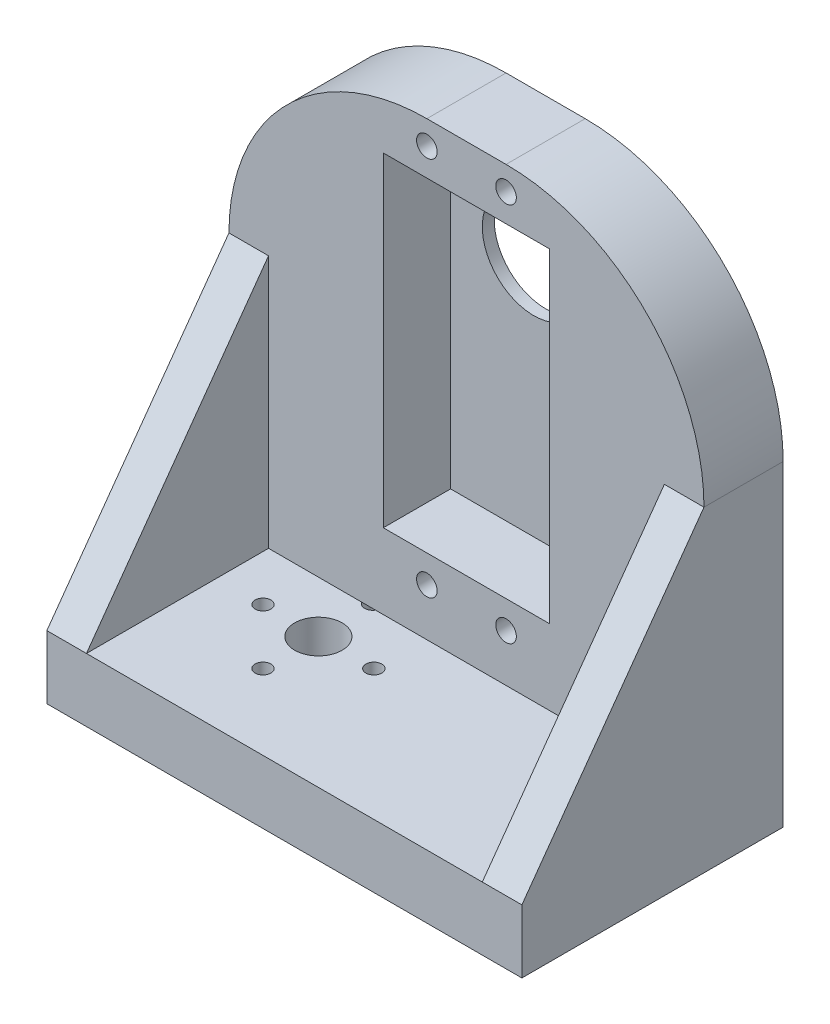
ISO-10303-21;
HEADER;
FILE_DESCRIPTION(('STEP AP214'),'2;1');
FILE_NAME('part.step','',(''),(''),'','','');
FILE_SCHEMA(('AUTOMOTIVE_DESIGN { 1 0 10303 214 1 1 1 1 }'));
ENDSEC;
DATA;
#1=APPLICATION_CONTEXT('core data for automotive mechanical design processes');
#2=APPLICATION_PROTOCOL_DEFINITION('international standard','automotive_design',2000,#1);
#3=PRODUCT_CONTEXT('',#1,'mechanical');
#4=PRODUCT('Part','Part','',(#3));
#5=PRODUCT_RELATED_PRODUCT_CATEGORY('part','',(#4));
#6=PRODUCT_DEFINITION_FORMATION('','',#4);
#7=PRODUCT_DEFINITION_CONTEXT('part definition',#1,'design');
#8=PRODUCT_DEFINITION('design','',#6,#7);
#9=PRODUCT_DEFINITION_SHAPE('','',#8);
#10=(LENGTH_UNIT() NAMED_UNIT(*) SI_UNIT(.MILLI.,.METRE.));
#11=(NAMED_UNIT(*) PLANE_ANGLE_UNIT() SI_UNIT($,.RADIAN.));
#12=(NAMED_UNIT(*) SI_UNIT($,.STERADIAN.) SOLID_ANGLE_UNIT());
#13=UNCERTAINTY_MEASURE_WITH_UNIT(LENGTH_MEASURE(1.E-05),#10,'distance_accuracy_value','');
#14=(GEOMETRIC_REPRESENTATION_CONTEXT(3) GLOBAL_UNCERTAINTY_ASSIGNED_CONTEXT((#13)) GLOBAL_UNIT_ASSIGNED_CONTEXT((#10,
#11,#12)) REPRESENTATION_CONTEXT('',''));
#15=CARTESIAN_POINT('',(0.,0.,0.));
#16=DIRECTION('',(0.,0.,1.));
#17=DIRECTION('',(1.,0.,0.));
#18=AXIS2_PLACEMENT_3D('',#15,#16,#17);
#19=CARTESIAN_POINT('',(-12.2,65.,0.));
#20=DIRECTION('',(0.,-1.,0.));
#21=DIRECTION('',(0.,0.,-1.));
#22=AXIS2_PLACEMENT_3D('',#19,#20,#21);
#23=CYLINDRICAL_SURFACE('',#22,3.);
#24=CARTESIAN_POINT('',(-12.2,8.,0.));
#25=DIRECTION('',(0.,-1.,0.));
#26=DIRECTION('',(0.,0.,-1.));
#27=AXIS2_PLACEMENT_3D('',#24,#25,#26);
#28=CIRCLE('',#27,3.);
#29=CARTESIAN_POINT('',(-12.2,8.,-3.));
#30=VERTEX_POINT('',#29);
#31=EDGE_CURVE('E243',#30,#30,#28,.T.);
#32=ORIENTED_EDGE('',*,*,#31,.F.);
#33=EDGE_LOOP('',(#32));
#34=FACE_BOUND('',#33,.T.);
#35=CARTESIAN_POINT('',(-12.2,2.3,0.));
#36=DIRECTION('',(0.,-1.,0.));
#37=DIRECTION('',(0.,0.,-1.));
#38=AXIS2_PLACEMENT_3D('',#35,#36,#37);
#39=CIRCLE('',#38,3.);
#40=CARTESIAN_POINT('',(-12.2,2.3,-3.));
#41=VERTEX_POINT('',#40);
#42=EDGE_CURVE('E265',#41,#41,#39,.F.);
#43=ORIENTED_EDGE('',*,*,#42,.F.);
#44=EDGE_LOOP('',(#43));
#45=FACE_BOUND('',#44,.T.);
#46=ADVANCED_FACE('F38',(#34,#45),#23,.F.);
#47=CARTESIAN_POINT('',(-19.2,65.,0.));
#48=DIRECTION('',(0.,-1.,0.));
#49=DIRECTION('',(0.,0.,-1.));
#50=AXIS2_PLACEMENT_3D('',#47,#48,#49);
#51=CYLINDRICAL_SURFACE('',#50,1.);
#52=CARTESIAN_POINT('',(-19.2,8.,0.));
#53=DIRECTION('',(0.,-1.,0.));
#54=DIRECTION('',(0.,0.,-1.));
#55=AXIS2_PLACEMENT_3D('',#52,#53,#54);
#56=CIRCLE('',#55,1.);
#57=CARTESIAN_POINT('',(-19.2,8.,-1.));
#58=VERTEX_POINT('',#57);
#59=EDGE_CURVE('E468',#58,#58,#56,.T.);
#60=ORIENTED_EDGE('',*,*,#59,.F.);
#61=EDGE_LOOP('',(#60));
#62=FACE_BOUND('',#61,.T.);
#63=CARTESIAN_POINT('',(-19.2,2.3,0.));
#64=DIRECTION('',(0.,-1.,0.));
#65=DIRECTION('',(0.,0.,-1.));
#66=AXIS2_PLACEMENT_3D('',#63,#64,#65);
#67=CIRCLE('',#66,1.);
#68=CARTESIAN_POINT('',(-19.2,2.3,-1.));
#69=VERTEX_POINT('',#68);
#70=EDGE_CURVE('E270',#69,#69,#67,.F.);
#71=ORIENTED_EDGE('',*,*,#70,.F.);
#72=EDGE_LOOP('',(#71));
#73=FACE_BOUND('',#72,.T.);
#74=ADVANCED_FACE('F302',(#62,#73),#51,.F.);
#75=CARTESIAN_POINT('',(-5.2,65.,0.));
#76=DIRECTION('',(0.,-1.,0.));
#77=DIRECTION('',(0.,0.,-1.));
#78=AXIS2_PLACEMENT_3D('',#75,#76,#77);
#79=CYLINDRICAL_SURFACE('',#78,1.);
#80=CARTESIAN_POINT('',(-5.2,8.,0.));
#81=DIRECTION('',(0.,-1.,0.));
#82=DIRECTION('',(0.,0.,-1.));
#83=AXIS2_PLACEMENT_3D('',#80,#81,#82);
#84=CIRCLE('',#83,1.);
#85=CARTESIAN_POINT('',(-5.2,8.,-1.));
#86=VERTEX_POINT('',#85);
#87=EDGE_CURVE('E466',#86,#86,#84,.T.);
#88=ORIENTED_EDGE('',*,*,#87,.F.);
#89=EDGE_LOOP('',(#88));
#90=FACE_BOUND('',#89,.T.);
#91=CARTESIAN_POINT('',(-5.2,2.3,0.));
#92=DIRECTION('',(0.,-1.,0.));
#93=DIRECTION('',(0.,0.,-1.));
#94=AXIS2_PLACEMENT_3D('',#91,#92,#93);
#95=CIRCLE('',#94,1.);
#96=CARTESIAN_POINT('',(-5.2,2.3,-1.));
#97=VERTEX_POINT('',#96);
#98=EDGE_CURVE('E273',#97,#97,#95,.F.);
#99=ORIENTED_EDGE('',*,*,#98,.F.);
#100=EDGE_LOOP('',(#99));
#101=FACE_BOUND('',#100,.T.);
#102=ADVANCED_FACE('F308',(#90,#101),#79,.F.);
#103=CARTESIAN_POINT('',(-12.2,65.,7.));
#104=DIRECTION('',(0.,-1.,0.));
#105=DIRECTION('',(0.,0.,-1.));
#106=AXIS2_PLACEMENT_3D('',#103,#104,#105);
#107=CYLINDRICAL_SURFACE('',#106,1.);
#108=CARTESIAN_POINT('',(-12.2,7.99999999999999,7.));
#109=DIRECTION('',(0.,-1.,0.));
#110=DIRECTION('',(0.,0.,-1.));
#111=AXIS2_PLACEMENT_3D('',#108,#109,#110);
#112=CIRCLE('',#111,1.);
#113=CARTESIAN_POINT('',(-12.2,7.99999999999999,6.));
#114=VERTEX_POINT('',#113);
#115=EDGE_CURVE('E223',#114,#114,#112,.T.);
#116=ORIENTED_EDGE('',*,*,#115,.F.);
#117=EDGE_LOOP('',(#116));
#118=FACE_BOUND('',#117,.T.);
#119=CARTESIAN_POINT('',(-12.2,2.3,7.));
#120=DIRECTION('',(0.,-1.,0.));
#121=DIRECTION('',(0.,0.,-1.));
#122=AXIS2_PLACEMENT_3D('',#119,#120,#121);
#123=CIRCLE('',#122,1.);
#124=CARTESIAN_POINT('',(-12.2,2.3,6.));
#125=VERTEX_POINT('',#124);
#126=EDGE_CURVE('E42',#125,#125,#123,.F.);
#127=ORIENTED_EDGE('',*,*,#126,.F.);
#128=EDGE_LOOP('',(#127));
#129=FACE_BOUND('',#128,.T.);
#130=ADVANCED_FACE('F314',(#118,#129),#107,.F.);
#131=CARTESIAN_POINT('',(30.,8.,-6.49999999999999));
#132=DIRECTION('',(0.,-1.,0.));
#133=DIRECTION('',(0.,0.,-1.));
#134=AXIS2_PLACEMENT_3D('',#131,#132,#133);
#135=PLANE('',#134);
#136=ORIENTED_EDGE('',*,*,#115,.T.);
#137=EDGE_LOOP('',(#136));
#138=FACE_BOUND('',#137,.T.);
#139=ORIENTED_EDGE('',*,*,#87,.T.);
#140=EDGE_LOOP('',(#139));
#141=FACE_BOUND('',#140,.T.);
#142=ORIENTED_EDGE('',*,*,#59,.T.);
#143=EDGE_LOOP('',(#142));
#144=FACE_BOUND('',#143,.T.);
#145=ORIENTED_EDGE('',*,*,#31,.T.);
#146=EDGE_LOOP('',(#145));
#147=FACE_BOUND('',#146,.T.);
#148=DIRECTION('',(-1.,0.,0.));
#149=VECTOR('',#148,1.);
#150=CARTESIAN_POINT('',(30.,8.,-6.49999999999999));
#151=LINE('',#150,#149);
#152=CARTESIAN_POINT('',(25.,8.,-6.49999999999999));
#153=VERTEX_POINT('',#152);
#154=CARTESIAN_POINT('',(-11.4848258860183,8.,-6.49999999999999));
#155=VERTEX_POINT('',#154);
#156=EDGE_CURVE('E152',#153,#155,#151,.T.);
#157=ORIENTED_EDGE('',*,*,#156,.T.);
#158=CARTESIAN_POINT('',(-12.3508512898027,8.,-7.));
#159=DIRECTION('',(0.,-1.,0.));
#160=DIRECTION('',(0.,0.,-1.));
#161=AXIS2_PLACEMENT_3D('',#158,#159,#160);
#162=CIRCLE('',#161,1.);
#163=CARTESIAN_POINT('',(-13.2168766935871,8.,-6.49999999999999));
#164=VERTEX_POINT('',#163);
#165=EDGE_CURVE('E53',#155,#164,#162,.T.);
#166=ORIENTED_EDGE('',*,*,#165,.T.);
#167=CARTESIAN_POINT('',(-25.,8.,-6.49999999999999));
#168=VERTEX_POINT('',#167);
#169=EDGE_CURVE('E153',#164,#168,#151,.T.);
#170=ORIENTED_EDGE('',*,*,#169,.T.);
#171=DIRECTION('',(0.,0.,1.));
#172=VECTOR('',#171,1.);
#173=CARTESIAN_POINT('',(-25.,7.99999999999999,16.5));
#174=LINE('',#173,#172);
#175=CARTESIAN_POINT('',(-25.,7.99999999999999,16.5));
#176=VERTEX_POINT('',#175);
#177=EDGE_CURVE('E250',#168,#176,#174,.T.);
#178=ORIENTED_EDGE('',*,*,#177,.T.);
#179=DIRECTION('',(-1.,0.,0.));
#180=VECTOR('',#179,1.);
#181=CARTESIAN_POINT('',(30.,7.99999999999999,16.5));
#182=LINE('',#181,#180);
#183=CARTESIAN_POINT('',(25.,7.99999999999999,16.5));
#184=VERTEX_POINT('',#183);
#185=EDGE_CURVE('E175',#184,#176,#182,.T.);
#186=ORIENTED_EDGE('',*,*,#185,.F.);
#187=DIRECTION('',(0.,0.,1.));
#188=VECTOR('',#187,1.);
#189=CARTESIAN_POINT('',(25.,7.99999999999999,16.5));
#190=LINE('',#189,#188);
#191=EDGE_CURVE('E254',#153,#184,#190,.T.);
#192=ORIENTED_EDGE('',*,*,#191,.F.);
#193=EDGE_LOOP('',(#157,#166,#170,#178,#186,#192));
#194=FACE_BOUND('',#193,.T.);
#195=ADVANCED_FACE('F160',(#138,#141,#144,#147,#194),#135,.F.);
#196=CARTESIAN_POINT('',(30.,65.,-6.5));
#197=DIRECTION('',(0.,0.,-1.));
#198=DIRECTION('',(0.,1.,0.));
#199=AXIS2_PLACEMENT_3D('',#196,#197,#198);
#200=PLANE('',#199);
#201=CARTESIAN_POINT('',(5.,62.,-6.49999999999999));
#202=DIRECTION('',(0.,0.,1.));
#203=DIRECTION('',(1.,0.,0.));
#204=AXIS2_PLACEMENT_3D('',#201,#202,#203);
#205=CIRCLE('',#204,1.3);
#206=CARTESIAN_POINT('',(6.3,62.,-6.49999999999999));
#207=VERTEX_POINT('',#206);
#208=EDGE_CURVE('E229',#207,#207,#205,.T.);
#209=ORIENTED_EDGE('',*,*,#208,.F.);
#210=EDGE_LOOP('',(#209));
#211=FACE_BOUND('',#210,.T.);
#212=DIRECTION('',(0.,1.,0.));
#213=VECTOR('',#212,1.);
#214=CARTESIAN_POINT('',(10.5,0.,-6.49999999999999));
#215=LINE('',#214,#213);
#216=CARTESIAN_POINT('',(10.5,17.5,-6.49999999999999));
#217=VERTEX_POINT('',#216);
#218=CARTESIAN_POINT('',(10.5,58.5,-6.49999999999999));
#219=VERTEX_POINT('',#218);
#220=EDGE_CURVE('E199',#217,#219,#215,.T.);
#221=ORIENTED_EDGE('',*,*,#220,.F.);
#222=DIRECTION('',(1.,0.,0.));
#223=VECTOR('',#222,1.);
#224=CARTESIAN_POINT('',(0.,17.5,-6.49999999999999));
#225=LINE('',#224,#223);
#226=CARTESIAN_POINT('',(-10.5,17.5,-6.49999999999999));
#227=VERTEX_POINT('',#226);
#228=EDGE_CURVE('E202',#227,#217,#225,.T.);
#229=ORIENTED_EDGE('',*,*,#228,.F.);
#230=DIRECTION('',(0.,1.,0.));
#231=VECTOR('',#230,1.);
#232=CARTESIAN_POINT('',(-10.5,0.,-6.49999999999999));
#233=LINE('',#232,#231);
#234=CARTESIAN_POINT('',(-10.5,58.5,-6.49999999999999));
#235=VERTEX_POINT('',#234);
#236=EDGE_CURVE('E192',#227,#235,#233,.T.);
#237=ORIENTED_EDGE('',*,*,#236,.T.);
#238=DIRECTION('',(1.,0.,0.));
#239=VECTOR('',#238,1.);
#240=CARTESIAN_POINT('',(0.,58.5,-6.49999999999999));
#241=LINE('',#240,#239);
#242=EDGE_CURVE('E196',#235,#219,#241,.T.);
#243=ORIENTED_EDGE('',*,*,#242,.T.);
#244=EDGE_LOOP('',(#221,#229,#237,#243));
#245=FACE_BOUND('',#244,.T.);
#246=CARTESIAN_POINT('',(5.,14.,-6.49999999999999));
#247=DIRECTION('',(0.,0.,1.));
#248=DIRECTION('',(1.,0.,0.));
#249=AXIS2_PLACEMENT_3D('',#246,#247,#248);
#250=CIRCLE('',#249,1.3);
#251=CARTESIAN_POINT('',(6.3,14.,-6.49999999999999));
#252=VERTEX_POINT('',#251);
#253=EDGE_CURVE('E213',#252,#252,#250,.F.);
#254=ORIENTED_EDGE('',*,*,#253,.T.);
#255=EDGE_LOOP('',(#254));
#256=FACE_BOUND('',#255,.T.);
#257=CARTESIAN_POINT('',(-5.,62.,-6.49999999999999));
#258=DIRECTION('',(0.,0.,1.));
#259=DIRECTION('',(1.,0.,0.));
#260=AXIS2_PLACEMENT_3D('',#257,#258,#259);
#261=CIRCLE('',#260,1.3);
#262=CARTESIAN_POINT('',(-3.7,62.,-6.49999999999999));
#263=VERTEX_POINT('',#262);
#264=EDGE_CURVE('E216',#263,#263,#261,.T.);
#265=ORIENTED_EDGE('',*,*,#264,.F.);
#266=EDGE_LOOP('',(#265));
#267=FACE_BOUND('',#266,.T.);
#268=CARTESIAN_POINT('',(-5.,14.,-6.49999999999999));
#269=DIRECTION('',(0.,0.,-1.));
#270=DIRECTION('',(-1.,0.,0.));
#271=AXIS2_PLACEMENT_3D('',#268,#269,#270);
#272=CIRCLE('',#271,1.3);
#273=CARTESIAN_POINT('',(-6.3,14.,-6.49999999999999));
#274=VERTEX_POINT('',#273);
#275=EDGE_CURVE('E222',#274,#274,#272,.T.);
#276=ORIENTED_EDGE('',*,*,#275,.T.);
#277=EDGE_LOOP('',(#276));
#278=FACE_BOUND('',#277,.T.);
#279=DIRECTION('',(1.,0.,0.));
#280=VECTOR('',#279,1.);
#281=CARTESIAN_POINT('',(25.,40.,-6.5));
#282=LINE('',#281,#280);
#283=CARTESIAN_POINT('',(25.,40.,-6.5));
#284=VERTEX_POINT('',#283);
#285=CARTESIAN_POINT('',(30.,40.,-6.5));
#286=VERTEX_POINT('',#285);
#287=EDGE_CURVE('E247',#284,#286,#282,.T.);
#288=ORIENTED_EDGE('',*,*,#287,.T.);
#289=CARTESIAN_POINT('',(4.99999999999999,40.,-6.5));
#290=DIRECTION('',(0.,0.,-1.));
#291=DIRECTION('',(0.,1.,0.));
#292=AXIS2_PLACEMENT_3D('',#289,#290,#291);
#293=CIRCLE('',#292,25.);
#294=CARTESIAN_POINT('',(4.99999999999999,65.,-6.5));
#295=VERTEX_POINT('',#294);
#296=EDGE_CURVE('E11',#286,#295,#293,.F.);
#297=ORIENTED_EDGE('',*,*,#296,.T.);
#298=DIRECTION('',(-1.,0.,0.));
#299=VECTOR('',#298,1.);
#300=CARTESIAN_POINT('',(30.,65.,-6.5));
#301=LINE('',#300,#299);
#302=CARTESIAN_POINT('',(-5.,65.,-6.5));
#303=VERTEX_POINT('',#302);
#304=EDGE_CURVE('E181',#295,#303,#301,.T.);
#305=ORIENTED_EDGE('',*,*,#304,.T.);
#306=CARTESIAN_POINT('',(-5.,40.,-6.5));
#307=DIRECTION('',(0.,0.,-1.));
#308=DIRECTION('',(0.,1.,0.));
#309=AXIS2_PLACEMENT_3D('',#306,#307,#308);
#310=CIRCLE('',#309,25.);
#311=CARTESIAN_POINT('',(-30.,40.,-6.5));
#312=VERTEX_POINT('',#311);
#313=EDGE_CURVE('E393',#303,#312,#310,.F.);
#314=ORIENTED_EDGE('',*,*,#313,.T.);
#315=DIRECTION('',(-1.,0.,0.));
#316=VECTOR('',#315,1.);
#317=CARTESIAN_POINT('',(-25.,40.,-6.5));
#318=LINE('',#317,#316);
#319=CARTESIAN_POINT('',(-25.,40.,-6.5));
#320=VERTEX_POINT('',#319);
#321=EDGE_CURVE('E239',#320,#312,#318,.T.);
#322=ORIENTED_EDGE('',*,*,#321,.F.);
#323=DIRECTION('',(0.,-1.,0.));
#324=VECTOR('',#323,1.);
#325=CARTESIAN_POINT('',(-25.,8.,-6.49999999999999));
#326=LINE('',#325,#324);
#327=EDGE_CURVE('E168',#320,#168,#326,.T.);
#328=ORIENTED_EDGE('',*,*,#327,.T.);
#329=ORIENTED_EDGE('',*,*,#169,.F.);
#330=EDGE_CURVE('E145',#155,#164,#151,.T.);
#331=ORIENTED_EDGE('',*,*,#330,.F.);
#332=ORIENTED_EDGE('',*,*,#156,.F.);
#333=DIRECTION('',(0.,-1.,0.));
#334=VECTOR('',#333,1.);
#335=CARTESIAN_POINT('',(25.,8.,-6.49999999999999));
#336=LINE('',#335,#334);
#337=EDGE_CURVE('E257',#284,#153,#336,.T.);
#338=ORIENTED_EDGE('',*,*,#337,.F.);
#339=EDGE_LOOP('',(#288,#297,#305,#314,#322,#328,#329,#331,#332,#338));
#340=FACE_BOUND('',#339,.T.);
#341=ADVANCED_FACE('F166',(#211,#245,#256,#267,#278,#340),#200,.F.);
#342=CARTESIAN_POINT('',(4.99999999999999,40.,16.5));
#343=DIRECTION('',(0.,0.,1.));
#344=DIRECTION('',(1.,0.,0.));
#345=AXIS2_PLACEMENT_3D('',#342,#343,#344);
#346=CYLINDRICAL_SURFACE('',#345,25.);
#347=DIRECTION('',(0.,0.,1.));
#348=VECTOR('',#347,1.);
#349=CARTESIAN_POINT('',(30.,40.,16.5));
#350=LINE('',#349,#348);
#351=CARTESIAN_POINT('',(30.,40.,-16.5));
#352=VERTEX_POINT('',#351);
#353=EDGE_CURVE('E423',#352,#286,#350,.T.);
#354=ORIENTED_EDGE('',*,*,#353,.F.);
#355=CARTESIAN_POINT('',(4.99999999999999,40.,-16.5));
#356=DIRECTION('',(0.,0.,1.));
#357=DIRECTION('',(1.,0.,0.));
#358=AXIS2_PLACEMENT_3D('',#355,#356,#357);
#359=CIRCLE('',#358,25.);
#360=CARTESIAN_POINT('',(4.99999999999999,65.,-16.5));
#361=VERTEX_POINT('',#360);
#362=EDGE_CURVE('E47',#361,#352,#359,.F.);
#363=ORIENTED_EDGE('',*,*,#362,.F.);
#364=DIRECTION('',(0.,0.,1.));
#365=VECTOR('',#364,1.);
#366=CARTESIAN_POINT('',(4.99999999999999,65.,0.));
#367=LINE('',#366,#365);
#368=EDGE_CURVE('E425',#295,#361,#367,.F.);
#369=ORIENTED_EDGE('',*,*,#368,.F.);
#370=ORIENTED_EDGE('',*,*,#296,.F.);
#371=EDGE_LOOP('',(#354,#363,#369,#370));
#372=FACE_BOUND('',#371,.T.);
#373=ADVANCED_FACE('F40',(#372),#346,.T.);
#374=CARTESIAN_POINT('',(-5.,40.,16.5));
#375=DIRECTION('',(0.,0.,-1.));
#376=DIRECTION('',(-1.,0.,0.));
#377=AXIS2_PLACEMENT_3D('',#374,#375,#376);
#378=CYLINDRICAL_SURFACE('',#377,25.);
#379=DIRECTION('',(0.,0.,-1.));
#380=VECTOR('',#379,1.);
#381=CARTESIAN_POINT('',(-30.,40.,16.5));
#382=LINE('',#381,#380);
#383=CARTESIAN_POINT('',(-30.,40.,-16.5));
#384=VERTEX_POINT('',#383);
#385=EDGE_CURVE('E391',#312,#384,#382,.T.);
#386=ORIENTED_EDGE('',*,*,#385,.F.);
#387=ORIENTED_EDGE('',*,*,#313,.F.);
#388=DIRECTION('',(0.,0.,-1.));
#389=VECTOR('',#388,1.);
#390=CARTESIAN_POINT('',(-5.,65.,0.));
#391=LINE('',#390,#389);
#392=CARTESIAN_POINT('',(-5.,65.,-16.5));
#393=VERTEX_POINT('',#392);
#394=EDGE_CURVE('E398',#393,#303,#391,.F.);
#395=ORIENTED_EDGE('',*,*,#394,.F.);
#396=CARTESIAN_POINT('',(-5.,40.,-16.5));
#397=DIRECTION('',(0.,0.,1.));
#398=DIRECTION('',(1.,0.,0.));
#399=AXIS2_PLACEMENT_3D('',#396,#397,#398);
#400=CIRCLE('',#399,25.);
#401=EDGE_CURVE('E396',#384,#393,#400,.F.);
#402=ORIENTED_EDGE('',*,*,#401,.F.);
#403=EDGE_LOOP('',(#386,#387,#395,#402));
#404=FACE_BOUND('',#403,.T.);
#405=ADVANCED_FACE('F378',(#404),#378,.T.);
#406=CARTESIAN_POINT('',(-30.,65.,-16.5));
#407=DIRECTION('',(0.,0.,1.));
#408=DIRECTION('',(1.,0.,0.));
#409=AXIS2_PLACEMENT_3D('',#406,#407,#408);
#410=PLANE('',#409);
#411=CARTESIAN_POINT('',(0.,48.2,-16.5));
#412=DIRECTION('',(0.,0.,1.));
#413=DIRECTION('',(1.,0.,0.));
#414=AXIS2_PLACEMENT_3D('',#411,#412,#413);
#415=CIRCLE('',#414,6.5);
#416=CARTESIAN_POINT('',(6.5,48.2,-16.5));
#417=VERTEX_POINT('',#416);
#418=EDGE_CURVE('E258',#417,#417,#415,.T.);
#419=ORIENTED_EDGE('',*,*,#418,.T.);
#420=EDGE_LOOP('',(#419));
#421=FACE_BOUND('',#420,.T.);
#422=CARTESIAN_POINT('',(-5.,14.,-16.5));
#423=DIRECTION('',(0.,0.,-1.));
#424=DIRECTION('',(-1.,0.,0.));
#425=AXIS2_PLACEMENT_3D('',#422,#423,#424);
#426=CIRCLE('',#425,1.3);
#427=CARTESIAN_POINT('',(-6.3,14.,-16.5));
#428=VERTEX_POINT('',#427);
#429=EDGE_CURVE('E219',#428,#428,#426,.T.);
#430=ORIENTED_EDGE('',*,*,#429,.F.);
#431=EDGE_LOOP('',(#430));
#432=FACE_BOUND('',#431,.T.);
#433=CARTESIAN_POINT('',(-5.,62.,-16.5));
#434=DIRECTION('',(0.,0.,1.));
#435=DIRECTION('',(1.,0.,0.));
#436=AXIS2_PLACEMENT_3D('',#433,#434,#435);
#437=CIRCLE('',#436,1.3);
#438=CARTESIAN_POINT('',(-3.7,62.,-16.5));
#439=VERTEX_POINT('',#438);
#440=EDGE_CURVE('E232',#439,#439,#437,.T.);
#441=ORIENTED_EDGE('',*,*,#440,.T.);
#442=EDGE_LOOP('',(#441));
#443=FACE_BOUND('',#442,.T.);
#444=CARTESIAN_POINT('',(5.,14.,-16.5));
#445=DIRECTION('',(0.,0.,1.));
#446=DIRECTION('',(1.,0.,0.));
#447=AXIS2_PLACEMENT_3D('',#444,#445,#446);
#448=CIRCLE('',#447,1.3);
#449=CARTESIAN_POINT('',(6.3,14.,-16.5));
#450=VERTEX_POINT('',#449);
#451=EDGE_CURVE('E204',#450,#450,#448,.F.);
#452=ORIENTED_EDGE('',*,*,#451,.F.);
#453=EDGE_LOOP('',(#452));
#454=FACE_BOUND('',#453,.T.);
#455=DIRECTION('',(-1.,0.,0.));
#456=VECTOR('',#455,1.);
#457=CARTESIAN_POINT('',(-30.,65.,-16.5));
#458=LINE('',#457,#456);
#459=EDGE_CURVE('E437',#361,#393,#458,.T.);
#460=ORIENTED_EDGE('',*,*,#459,.F.);
#461=ORIENTED_EDGE('',*,*,#362,.T.);
#462=DIRECTION('',(0.,-1.,0.));
#463=VECTOR('',#462,1.);
#464=CARTESIAN_POINT('',(30.,65.,-16.5));
#465=LINE('',#464,#463);
#466=CARTESIAN_POINT('',(30.,0.,-16.5));
#467=VERTEX_POINT('',#466);
#468=EDGE_CURVE('E399',#352,#467,#465,.T.);
#469=ORIENTED_EDGE('',*,*,#468,.T.);
#470=DIRECTION('',(-1.,0.,0.));
#471=VECTOR('',#470,1.);
#472=CARTESIAN_POINT('',(-30.,0.,-16.5));
#473=LINE('',#472,#471);
#474=CARTESIAN_POINT('',(-30.,0.,-16.5));
#475=VERTEX_POINT('',#474);
#476=EDGE_CURVE('E484',#467,#475,#473,.T.);
#477=ORIENTED_EDGE('',*,*,#476,.T.);
#478=DIRECTION('',(0.,-1.,0.));
#479=VECTOR('',#478,1.);
#480=CARTESIAN_POINT('',(-30.,65.,-16.5));
#481=LINE('',#480,#479);
#482=EDGE_CURVE('E411',#384,#475,#481,.T.);
#483=ORIENTED_EDGE('',*,*,#482,.F.);
#484=ORIENTED_EDGE('',*,*,#401,.T.);
#485=EDGE_LOOP('',(#460,#461,#469,#477,#483,#484));
#486=FACE_BOUND('',#485,.T.);
#487=CARTESIAN_POINT('',(5.,62.,-16.5));
#488=DIRECTION('',(0.,0.,1.));
#489=DIRECTION('',(1.,0.,0.));
#490=AXIS2_PLACEMENT_3D('',#487,#488,#489);
#491=CIRCLE('',#490,1.3);
#492=CARTESIAN_POINT('',(6.3,62.,-16.5));
#493=VERTEX_POINT('',#492);
#494=EDGE_CURVE('E226',#493,#493,#491,.T.);
#495=ORIENTED_EDGE('',*,*,#494,.T.);
#496=EDGE_LOOP('',(#495));
#497=FACE_BOUND('',#496,.T.);
#498=ADVANCED_FACE('F375',(#421,#432,#443,#454,#486,#497),#410,.F.);
#499=CARTESIAN_POINT('',(30.,65.,16.5));
#500=DIRECTION('',(-1.,0.,0.));
#501=DIRECTION('',(0.,0.,1.));
#502=AXIS2_PLACEMENT_3D('',#499,#500,#501);
#503=PLANE('',#502);
#504=ORIENTED_EDGE('',*,*,#468,.F.);
#505=ORIENTED_EDGE('',*,*,#353,.T.);
#506=DIRECTION('',(0.,0.812015371342714,-0.583636048152575));
#507=VECTOR('',#506,1.);
#508=CARTESIAN_POINT('',(30.,40.,-6.5));
#509=LINE('',#508,#507);
#510=CARTESIAN_POINT('',(30.,7.99999999999999,16.5));
#511=VERTEX_POINT('',#510);
#512=EDGE_CURVE('E255',#511,#286,#509,.T.);
#513=ORIENTED_EDGE('',*,*,#512,.F.);
#514=DIRECTION('',(0.,-1.,0.));
#515=VECTOR('',#514,1.);
#516=CARTESIAN_POINT('',(30.,65.,16.5));
#517=LINE('',#516,#515);
#518=CARTESIAN_POINT('',(30.,0.,16.5));
#519=VERTEX_POINT('',#518);
#520=EDGE_CURVE('E412',#511,#519,#517,.T.);
#521=ORIENTED_EDGE('',*,*,#520,.T.);
#522=DIRECTION('',(0.,0.,-1.));
#523=VECTOR('',#522,1.);
#524=CARTESIAN_POINT('',(30.,0.,16.5));
#525=LINE('',#524,#523);
#526=EDGE_CURVE('E184',#519,#467,#525,.T.);
#527=ORIENTED_EDGE('',*,*,#526,.T.);
#528=EDGE_LOOP('',(#504,#505,#513,#521,#527));
#529=FACE_BOUND('',#528,.T.);
#530=ADVANCED_FACE('F373',(#529),#503,.F.);
#531=CARTESIAN_POINT('',(-30.,65.,16.5));
#532=DIRECTION('',(1.,0.,0.));
#533=DIRECTION('',(0.,0.,-1.));
#534=AXIS2_PLACEMENT_3D('',#531,#532,#533);
#535=PLANE('',#534);
#536=DIRECTION('',(0.,0.812015371342714,-0.583636048152575));
#537=VECTOR('',#536,1.);
#538=CARTESIAN_POINT('',(-30.,40.,-6.5));
#539=LINE('',#538,#537);
#540=CARTESIAN_POINT('',(-30.,7.99999999999999,16.5));
#541=VERTEX_POINT('',#540);
#542=EDGE_CURVE('E244',#541,#312,#539,.T.);
#543=ORIENTED_EDGE('',*,*,#542,.T.);
#544=ORIENTED_EDGE('',*,*,#385,.T.);
#545=ORIENTED_EDGE('',*,*,#482,.T.);
#546=DIRECTION('',(0.,0.,1.));
#547=VECTOR('',#546,1.);
#548=CARTESIAN_POINT('',(-30.,0.,16.5));
#549=LINE('',#548,#547);
#550=CARTESIAN_POINT('',(-30.,0.,16.5));
#551=VERTEX_POINT('',#550);
#552=EDGE_CURVE('E408',#475,#551,#549,.T.);
#553=ORIENTED_EDGE('',*,*,#552,.T.);
#554=DIRECTION('',(0.,-1.,0.));
#555=VECTOR('',#554,1.);
#556=CARTESIAN_POINT('',(-30.,65.,16.5));
#557=LINE('',#556,#555);
#558=EDGE_CURVE('E406',#541,#551,#557,.T.);
#559=ORIENTED_EDGE('',*,*,#558,.F.);
#560=EDGE_LOOP('',(#543,#544,#545,#553,#559));
#561=FACE_BOUND('',#560,.T.);
#562=ADVANCED_FACE('F370',(#561),#535,.F.);
#563=CARTESIAN_POINT('',(-30.,65.,16.5));
#564=DIRECTION('',(0.,0.,-1.));
#565=DIRECTION('',(-1.,0.,0.));
#566=AXIS2_PLACEMENT_3D('',#563,#564,#565);
#567=PLANE('',#566);
#568=ORIENTED_EDGE('',*,*,#520,.F.);
#569=EDGE_CURVE('E176',#511,#184,#182,.T.);
#570=ORIENTED_EDGE('',*,*,#569,.T.);
#571=ORIENTED_EDGE('',*,*,#185,.T.);
#572=DIRECTION('',(-1.,0.,0.));
#573=VECTOR('',#572,1.);
#574=CARTESIAN_POINT('',(-25.,7.99999999999999,16.5));
#575=LINE('',#574,#573);
#576=EDGE_CURVE('E237',#176,#541,#575,.T.);
#577=ORIENTED_EDGE('',*,*,#576,.T.);
#578=ORIENTED_EDGE('',*,*,#558,.T.);
#579=DIRECTION('',(1.,0.,0.));
#580=VECTOR('',#579,1.);
#581=CARTESIAN_POINT('',(-30.,0.,16.5));
#582=LINE('',#581,#580);
#583=EDGE_CURVE('E481',#551,#519,#582,.T.);
#584=ORIENTED_EDGE('',*,*,#583,.T.);
#585=EDGE_LOOP('',(#568,#570,#571,#577,#578,#584));
#586=FACE_BOUND('',#585,.T.);
#587=ADVANCED_FACE('F363',(#586),#567,.F.);
#588=CARTESIAN_POINT('',(0.,65.,0.));
#589=DIRECTION('',(0.,-1.,0.));
#590=DIRECTION('',(0.,0.,-1.));
#591=AXIS2_PLACEMENT_3D('',#588,#589,#590);
#592=PLANE('',#591);
#593=ORIENTED_EDGE('',*,*,#304,.F.);
#594=ORIENTED_EDGE('',*,*,#368,.T.);
#595=ORIENTED_EDGE('',*,*,#459,.T.);
#596=ORIENTED_EDGE('',*,*,#394,.T.);
#597=EDGE_LOOP('',(#593,#594,#595,#596));
#598=FACE_BOUND('',#597,.T.);
#599=ADVANCED_FACE('F360',(#598),#592,.F.);
#600=CARTESIAN_POINT('',(0.,0.,0.));
#601=DIRECTION('',(0.,-1.,0.));
#602=DIRECTION('',(0.,0.,-1.));
#603=AXIS2_PLACEMENT_3D('',#600,#601,#602);
#604=PLANE('',#603);
#605=CARTESIAN_POINT('',(-12.2,0.,0.));
#606=DIRECTION('',(0.,-1.,0.));
#607=DIRECTION('',(0.,0.,-1.));
#608=AXIS2_PLACEMENT_3D('',#605,#606,#607);
#609=CIRCLE('',#608,10.5);
#610=CARTESIAN_POINT('',(-12.2,0.,-10.5));
#611=VERTEX_POINT('',#610);
#612=EDGE_CURVE('E164',#611,#611,#609,.T.);
#613=ORIENTED_EDGE('',*,*,#612,.F.);
#614=EDGE_LOOP('',(#613));
#615=FACE_BOUND('',#614,.T.);
#616=ORIENTED_EDGE('',*,*,#526,.F.);
#617=ORIENTED_EDGE('',*,*,#583,.F.);
#618=ORIENTED_EDGE('',*,*,#552,.F.);
#619=ORIENTED_EDGE('',*,*,#476,.F.);
#620=EDGE_LOOP('',(#616,#617,#618,#619));
#621=FACE_BOUND('',#620,.T.);
#622=ADVANCED_FACE('F352',(#615,#621),#604,.T.);
#623=CARTESIAN_POINT('',(0.,17.5,-15.));
#624=DIRECTION('',(0.,-1.,0.));
#625=DIRECTION('',(0.,0.,-1.));
#626=AXIS2_PLACEMENT_3D('',#623,#624,#625);
#627=PLANE('',#626);
#628=ORIENTED_EDGE('',*,*,#228,.T.);
#629=DIRECTION('',(0.,0.,1.));
#630=VECTOR('',#629,1.);
#631=CARTESIAN_POINT('',(10.5,17.5,-15.));
#632=LINE('',#631,#630);
#633=CARTESIAN_POINT('',(10.5,17.5,-15.));
#634=VERTEX_POINT('',#633);
#635=EDGE_CURVE('E185',#634,#217,#632,.T.);
#636=ORIENTED_EDGE('',*,*,#635,.F.);
#637=DIRECTION('',(1.,0.,0.));
#638=VECTOR('',#637,1.);
#639=CARTESIAN_POINT('',(0.,17.5,-15.));
#640=LINE('',#639,#638);
#641=CARTESIAN_POINT('',(-10.5,17.5,-15.));
#642=VERTEX_POINT('',#641);
#643=EDGE_CURVE('E195',#642,#634,#640,.T.);
#644=ORIENTED_EDGE('',*,*,#643,.F.);
#645=DIRECTION('',(0.,0.,1.));
#646=VECTOR('',#645,1.);
#647=CARTESIAN_POINT('',(-10.5,17.5,-15.));
#648=LINE('',#647,#646);
#649=EDGE_CURVE('E170',#642,#227,#648,.T.);
#650=ORIENTED_EDGE('',*,*,#649,.T.);
#651=EDGE_LOOP('',(#628,#636,#644,#650));
#652=FACE_BOUND('',#651,.T.);
#653=ADVANCED_FACE('F342',(#652),#627,.F.);
#654=CARTESIAN_POINT('',(-10.5,0.,-15.));
#655=DIRECTION('',(1.,0.,0.));
#656=DIRECTION('',(0.,0.,-1.));
#657=AXIS2_PLACEMENT_3D('',#654,#655,#656);
#658=PLANE('',#657);
#659=ORIENTED_EDGE('',*,*,#236,.F.);
#660=ORIENTED_EDGE('',*,*,#649,.F.);
#661=DIRECTION('',(0.,1.,0.));
#662=VECTOR('',#661,1.);
#663=CARTESIAN_POINT('',(-10.5,0.,-15.));
#664=LINE('',#663,#662);
#665=CARTESIAN_POINT('',(-10.5,58.5,-15.));
#666=VERTEX_POINT('',#665);
#667=EDGE_CURVE('E189',#642,#666,#664,.T.);
#668=ORIENTED_EDGE('',*,*,#667,.T.);
#669=DIRECTION('',(0.,0.,1.));
#670=VECTOR('',#669,1.);
#671=CARTESIAN_POINT('',(-10.5,58.5,-15.));
#672=LINE('',#671,#670);
#673=EDGE_CURVE('E171',#666,#235,#672,.T.);
#674=ORIENTED_EDGE('',*,*,#673,.T.);
#675=EDGE_LOOP('',(#659,#660,#668,#674));
#676=FACE_BOUND('',#675,.T.);
#677=ADVANCED_FACE('F338',(#676),#658,.T.);
#678=CARTESIAN_POINT('',(0.,58.5,-15.));
#679=DIRECTION('',(0.,-1.,0.));
#680=DIRECTION('',(0.,0.,-1.));
#681=AXIS2_PLACEMENT_3D('',#678,#679,#680);
#682=PLANE('',#681);
#683=ORIENTED_EDGE('',*,*,#242,.F.);
#684=ORIENTED_EDGE('',*,*,#673,.F.);
#685=DIRECTION('',(1.,0.,0.));
#686=VECTOR('',#685,1.);
#687=CARTESIAN_POINT('',(0.,58.5,-15.));
#688=LINE('',#687,#686);
#689=CARTESIAN_POINT('',(10.5,58.5,-15.));
#690=VERTEX_POINT('',#689);
#691=EDGE_CURVE('E206',#666,#690,#688,.T.);
#692=ORIENTED_EDGE('',*,*,#691,.T.);
#693=DIRECTION('',(0.,0.,1.));
#694=VECTOR('',#693,1.);
#695=CARTESIAN_POINT('',(10.5,58.5,-15.));
#696=LINE('',#695,#694);
#697=EDGE_CURVE('E188',#690,#219,#696,.T.);
#698=ORIENTED_EDGE('',*,*,#697,.T.);
#699=EDGE_LOOP('',(#683,#684,#692,#698));
#700=FACE_BOUND('',#699,.T.);
#701=ADVANCED_FACE('F341',(#700),#682,.T.);
#702=CARTESIAN_POINT('',(10.5,0.,-15.));
#703=DIRECTION('',(1.,0.,0.));
#704=DIRECTION('',(0.,0.,-1.));
#705=AXIS2_PLACEMENT_3D('',#702,#703,#704);
#706=PLANE('',#705);
#707=ORIENTED_EDGE('',*,*,#220,.T.);
#708=ORIENTED_EDGE('',*,*,#697,.F.);
#709=DIRECTION('',(0.,1.,0.));
#710=VECTOR('',#709,1.);
#711=CARTESIAN_POINT('',(10.5,0.,-15.));
#712=LINE('',#711,#710);
#713=EDGE_CURVE('E208',#634,#690,#712,.T.);
#714=ORIENTED_EDGE('',*,*,#713,.F.);
#715=ORIENTED_EDGE('',*,*,#635,.T.);
#716=EDGE_LOOP('',(#707,#708,#714,#715));
#717=FACE_BOUND('',#716,.T.);
#718=ADVANCED_FACE('F336',(#717),#706,.F.);
#719=CARTESIAN_POINT('',(0.,0.,-15.));
#720=DIRECTION('',(0.,0.,1.));
#721=DIRECTION('',(1.,0.,0.));
#722=AXIS2_PLACEMENT_3D('',#719,#720,#721);
#723=PLANE('',#722);
#724=CARTESIAN_POINT('',(0.,48.2,-15.));
#725=DIRECTION('',(0.,0.,1.));
#726=DIRECTION('',(1.,0.,0.));
#727=AXIS2_PLACEMENT_3D('',#724,#725,#726);
#728=CIRCLE('',#727,6.5);
#729=CARTESIAN_POINT('',(6.5,48.2,-15.));
#730=VERTEX_POINT('',#729);
#731=EDGE_CURVE('E262',#730,#730,#728,.T.);
#732=ORIENTED_EDGE('',*,*,#731,.F.);
#733=EDGE_LOOP('',(#732));
#734=FACE_BOUND('',#733,.T.);
#735=ORIENTED_EDGE('',*,*,#643,.T.);
#736=ORIENTED_EDGE('',*,*,#713,.T.);
#737=ORIENTED_EDGE('',*,*,#691,.F.);
#738=ORIENTED_EDGE('',*,*,#667,.F.);
#739=EDGE_LOOP('',(#735,#736,#737,#738));
#740=FACE_BOUND('',#739,.T.);
#741=ADVANCED_FACE('F332',(#734,#740),#723,.T.);
#742=CARTESIAN_POINT('',(5.,14.,-16.5));
#743=DIRECTION('',(0.,0.,1.));
#744=DIRECTION('',(1.,0.,0.));
#745=AXIS2_PLACEMENT_3D('',#742,#743,#744);
#746=CYLINDRICAL_SURFACE('',#745,1.3);
#747=ORIENTED_EDGE('',*,*,#451,.T.);
#748=EDGE_LOOP('',(#747));
#749=FACE_BOUND('',#748,.T.);
#750=ORIENTED_EDGE('',*,*,#253,.F.);
#751=EDGE_LOOP('',(#750));
#752=FACE_BOUND('',#751,.T.);
#753=ADVANCED_FACE('F320',(#749,#752),#746,.F.);
#754=CARTESIAN_POINT('',(-5.,62.,-16.5));
#755=DIRECTION('',(0.,0.,1.));
#756=DIRECTION('',(1.,0.,0.));
#757=AXIS2_PLACEMENT_3D('',#754,#755,#756);
#758=CYLINDRICAL_SURFACE('',#757,1.3);
#759=ORIENTED_EDGE('',*,*,#440,.F.);
#760=EDGE_LOOP('',(#759));
#761=FACE_BOUND('',#760,.T.);
#762=ORIENTED_EDGE('',*,*,#264,.T.);
#763=EDGE_LOOP('',(#762));
#764=FACE_BOUND('',#763,.T.);
#765=ADVANCED_FACE('F316',(#761,#764),#758,.F.);
#766=CARTESIAN_POINT('',(5.,62.,-16.5));
#767=DIRECTION('',(0.,0.,1.));
#768=DIRECTION('',(1.,0.,0.));
#769=AXIS2_PLACEMENT_3D('',#766,#767,#768);
#770=CYLINDRICAL_SURFACE('',#769,1.3);
#771=ORIENTED_EDGE('',*,*,#494,.F.);
#772=EDGE_LOOP('',(#771));
#773=FACE_BOUND('',#772,.T.);
#774=ORIENTED_EDGE('',*,*,#208,.T.);
#775=EDGE_LOOP('',(#774));
#776=FACE_BOUND('',#775,.T.);
#777=ADVANCED_FACE('F319',(#773,#776),#770,.F.);
#778=CARTESIAN_POINT('',(-5.,14.,-16.5));
#779=DIRECTION('',(0.,0.,1.));
#780=DIRECTION('',(1.,0.,0.));
#781=AXIS2_PLACEMENT_3D('',#778,#779,#780);
#782=CYLINDRICAL_SURFACE('',#781,1.3);
#783=ORIENTED_EDGE('',*,*,#429,.T.);
#784=EDGE_LOOP('',(#783));
#785=FACE_BOUND('',#784,.T.);
#786=ORIENTED_EDGE('',*,*,#275,.F.);
#787=EDGE_LOOP('',(#786));
#788=FACE_BOUND('',#787,.T.);
#789=ADVANCED_FACE('F324',(#785,#788),#782,.F.);
#790=CARTESIAN_POINT('',(-25.,40.,-6.5));
#791=DIRECTION('',(0.,0.583636048152575,0.812015371342714));
#792=DIRECTION('',(0.,-0.812015371342714,0.583636048152575));
#793=AXIS2_PLACEMENT_3D('',#790,#791,#792);
#794=PLANE('',#793);
#795=ORIENTED_EDGE('',*,*,#542,.F.);
#796=ORIENTED_EDGE('',*,*,#576,.F.);
#797=DIRECTION('',(0.,0.812015371342714,-0.583636048152575));
#798=VECTOR('',#797,1.);
#799=CARTESIAN_POINT('',(-25.,40.,-6.5));
#800=LINE('',#799,#798);
#801=EDGE_CURVE('E240',#176,#320,#800,.T.);
#802=ORIENTED_EDGE('',*,*,#801,.T.);
#803=ORIENTED_EDGE('',*,*,#321,.T.);
#804=EDGE_LOOP('',(#795,#796,#802,#803));
#805=FACE_BOUND('',#804,.T.);
#806=ADVANCED_FACE('F328',(#805),#794,.T.);
#807=CARTESIAN_POINT('',(-25.,0.,0.));
#808=DIRECTION('',(-1.,0.,0.));
#809=DIRECTION('',(0.,0.,1.));
#810=AXIS2_PLACEMENT_3D('',#807,#808,#809);
#811=PLANE('',#810);
#812=ORIENTED_EDGE('',*,*,#327,.F.);
#813=ORIENTED_EDGE('',*,*,#801,.F.);
#814=ORIENTED_EDGE('',*,*,#177,.F.);
#815=EDGE_LOOP('',(#812,#813,#814));
#816=FACE_BOUND('',#815,.T.);
#817=ADVANCED_FACE('F416',(#816),#811,.F.);
#818=CARTESIAN_POINT('',(25.,40.,-6.5));
#819=DIRECTION('',(0.,-0.583636048152575,-0.812015371342714));
#820=DIRECTION('',(0.,0.812015371342714,-0.583636048152575));
#821=AXIS2_PLACEMENT_3D('',#818,#819,#820);
#822=PLANE('',#821);
#823=ORIENTED_EDGE('',*,*,#512,.T.);
#824=ORIENTED_EDGE('',*,*,#287,.F.);
#825=DIRECTION('',(0.,0.812015371342714,-0.583636048152575));
#826=VECTOR('',#825,1.);
#827=CARTESIAN_POINT('',(25.,40.,-6.5));
#828=LINE('',#827,#826);
#829=EDGE_CURVE('E61',#184,#284,#828,.T.);
#830=ORIENTED_EDGE('',*,*,#829,.F.);
#831=ORIENTED_EDGE('',*,*,#569,.F.);
#832=EDGE_LOOP('',(#823,#824,#830,#831));
#833=FACE_BOUND('',#832,.T.);
#834=ADVANCED_FACE('F418',(#833),#822,.F.);
#835=CARTESIAN_POINT('',(25.,0.,0.));
#836=DIRECTION('',(1.,0.,0.));
#837=DIRECTION('',(0.,0.,1.));
#838=AXIS2_PLACEMENT_3D('',#835,#836,#837);
#839=PLANE('',#838);
#840=ORIENTED_EDGE('',*,*,#337,.T.);
#841=ORIENTED_EDGE('',*,*,#191,.T.);
#842=ORIENTED_EDGE('',*,*,#829,.T.);
#843=EDGE_LOOP('',(#840,#841,#842));
#844=FACE_BOUND('',#843,.T.);
#845=ADVANCED_FACE('F442',(#844),#839,.F.);
#846=CARTESIAN_POINT('',(0.,48.2,-16.5));
#847=DIRECTION('',(0.,0.,1.));
#848=DIRECTION('',(1.,0.,0.));
#849=AXIS2_PLACEMENT_3D('',#846,#847,#848);
#850=CYLINDRICAL_SURFACE('',#849,6.5);
#851=ORIENTED_EDGE('',*,*,#418,.F.);
#852=EDGE_LOOP('',(#851));
#853=FACE_BOUND('',#852,.T.);
#854=ORIENTED_EDGE('',*,*,#731,.T.);
#855=EDGE_LOOP('',(#854));
#856=FACE_BOUND('',#855,.T.);
#857=ADVANCED_FACE('F288',(#853,#856),#850,.F.);
#858=CARTESIAN_POINT('',(-12.2,2.3,0.));
#859=DIRECTION('',(0.,-1.,0.));
#860=DIRECTION('',(0.,0.,-1.));
#861=AXIS2_PLACEMENT_3D('',#858,#859,#860);
#862=PLANE('',#861);
#863=CARTESIAN_POINT('',(-12.3508512898027,2.3,-7.));
#864=DIRECTION('',(0.,-1.,0.));
#865=DIRECTION('',(0.,0.,-1.));
#866=AXIS2_PLACEMENT_3D('',#863,#864,#865);
#867=CIRCLE('',#866,1.);
#868=CARTESIAN_POINT('',(-12.3508512898027,2.3,-8.));
#869=VERTEX_POINT('',#868);
#870=EDGE_CURVE('E157',#869,#869,#867,.T.);
#871=ORIENTED_EDGE('',*,*,#870,.F.);
#872=EDGE_LOOP('',(#871));
#873=FACE_BOUND('',#872,.T.);
#874=CARTESIAN_POINT('',(-12.2,2.3,0.));
#875=DIRECTION('',(0.,-1.,0.));
#876=DIRECTION('',(0.,0.,-1.));
#877=AXIS2_PLACEMENT_3D('',#874,#875,#876);
#878=CIRCLE('',#877,10.5);
#879=CARTESIAN_POINT('',(-12.2,2.3,-10.5));
#880=VERTEX_POINT('',#879);
#881=EDGE_CURVE('E278',#880,#880,#878,.T.);
#882=ORIENTED_EDGE('',*,*,#881,.T.);
#883=EDGE_LOOP('',(#882));
#884=FACE_BOUND('',#883,.T.);
#885=ORIENTED_EDGE('',*,*,#126,.T.);
#886=EDGE_LOOP('',(#885));
#887=FACE_BOUND('',#886,.T.);
#888=ORIENTED_EDGE('',*,*,#98,.T.);
#889=EDGE_LOOP('',(#888));
#890=FACE_BOUND('',#889,.T.);
#891=ORIENTED_EDGE('',*,*,#70,.T.);
#892=EDGE_LOOP('',(#891));
#893=FACE_BOUND('',#892,.T.);
#894=ORIENTED_EDGE('',*,*,#42,.T.);
#895=EDGE_LOOP('',(#894));
#896=FACE_BOUND('',#895,.T.);
#897=ADVANCED_FACE('F284',(#873,#884,#887,#890,#893,#896),#862,.T.);
#898=CARTESIAN_POINT('',(-12.2,2.3,0.));
#899=DIRECTION('',(0.,-1.,0.));
#900=DIRECTION('',(0.,0.,-1.));
#901=AXIS2_PLACEMENT_3D('',#898,#899,#900);
#902=CYLINDRICAL_SURFACE('',#901,10.5);
#903=ORIENTED_EDGE('',*,*,#881,.F.);
#904=EDGE_LOOP('',(#903));
#905=FACE_BOUND('',#904,.T.);
#906=ORIENTED_EDGE('',*,*,#612,.T.);
#907=EDGE_LOOP('',(#906));
#908=FACE_BOUND('',#907,.T.);
#909=ADVANCED_FACE('F287',(#905,#908),#902,.F.);
#910=CARTESIAN_POINT('',(-12.3508512898027,8.,-7.));
#911=DIRECTION('',(0.,-1.,0.));
#912=DIRECTION('',(0.,0.,-1.));
#913=AXIS2_PLACEMENT_3D('',#910,#911,#912);
#914=PLANE('',#913);
#915=ORIENTED_EDGE('',*,*,#330,.T.);
#916=EDGE_CURVE('E147',#164,#155,#162,.T.);
#917=ORIENTED_EDGE('',*,*,#916,.T.);
#918=EDGE_LOOP('',(#915,#917));
#919=FACE_BOUND('',#918,.T.);
#920=ADVANCED_FACE('F146',(#919),#914,.T.);
#921=CARTESIAN_POINT('',(-12.3508512898027,8.,-7.));
#922=DIRECTION('',(0.,-1.,0.));
#923=DIRECTION('',(0.,0.,-1.));
#924=AXIS2_PLACEMENT_3D('',#921,#922,#923);
#925=CYLINDRICAL_SURFACE('',#924,1.);
#926=ORIENTED_EDGE('',*,*,#165,.F.);
#927=ORIENTED_EDGE('',*,*,#916,.F.);
#928=EDGE_LOOP('',(#926,#927));
#929=FACE_BOUND('',#928,.T.);
#930=ORIENTED_EDGE('',*,*,#870,.T.);
#931=EDGE_LOOP('',(#930));
#932=FACE_BOUND('',#931,.T.);
#933=ADVANCED_FACE('F155',(#929,#932),#925,.F.);
#934=CLOSED_SHELL('',(#46,#74,#102,#130,#195,#341,#373,#405,#498,#530,#562,#587,#599,#622,#653,
#677,#701,#718,#741,#753,#765,#777,#789,#806,#817,#834,#845,#857,#897,#909,#920,#933));
#935=MANIFOLD_SOLID_BREP('B2',#934);
#936=ADVANCED_BREP_SHAPE_REPRESENTATION('',(#18,#935),#14);
#937=SHAPE_DEFINITION_REPRESENTATION(#9,#936);
ENDSEC;
END-ISO-10303-21;
